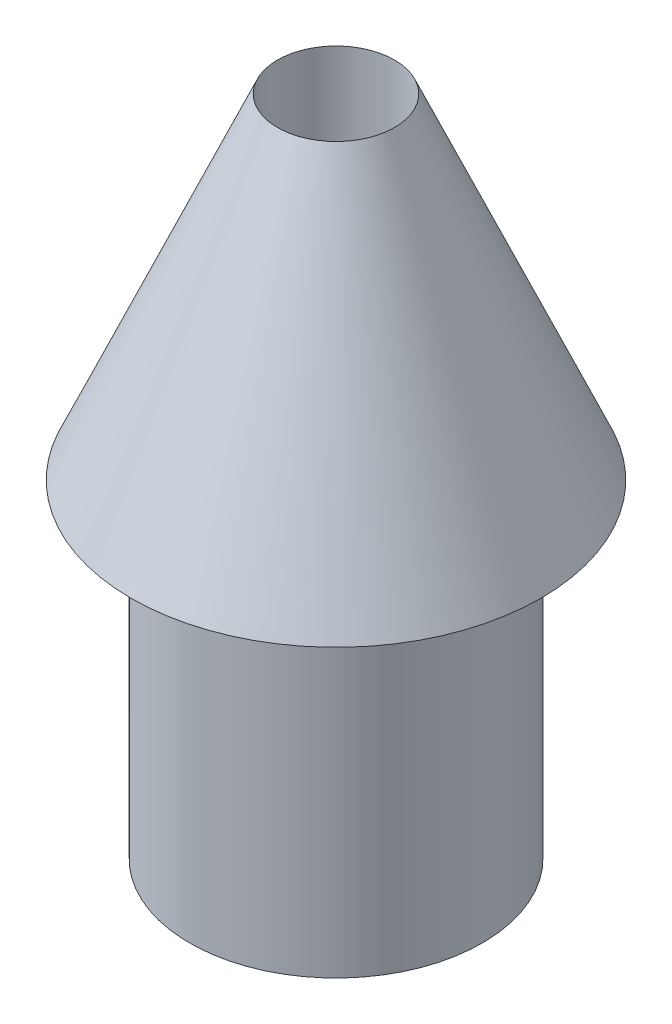
ISO-10303-21;
HEADER;
FILE_DESCRIPTION(('STEP AP214'),'2;1');
FILE_NAME('part.step','',(''),(''),'','','');
FILE_SCHEMA(('AUTOMOTIVE_DESIGN { 1 0 10303 214 1 1 1 1 }'));
ENDSEC;
DATA;
#1=APPLICATION_CONTEXT('core data for automotive mechanical design processes');
#2=APPLICATION_PROTOCOL_DEFINITION('international standard','automotive_design',2000,#1);
#3=PRODUCT_CONTEXT('',#1,'mechanical');
#4=PRODUCT('Part','Part','',(#3));
#5=PRODUCT_RELATED_PRODUCT_CATEGORY('part','',(#4));
#6=PRODUCT_DEFINITION_FORMATION('','',#4);
#7=PRODUCT_DEFINITION_CONTEXT('part definition',#1,'design');
#8=PRODUCT_DEFINITION('design','',#6,#7);
#9=PRODUCT_DEFINITION_SHAPE('','',#8);
#10=(LENGTH_UNIT() NAMED_UNIT(*) SI_UNIT(.MILLI.,.METRE.));
#11=(NAMED_UNIT(*) PLANE_ANGLE_UNIT() SI_UNIT($,.RADIAN.));
#12=(NAMED_UNIT(*) SI_UNIT($,.STERADIAN.) SOLID_ANGLE_UNIT());
#13=UNCERTAINTY_MEASURE_WITH_UNIT(LENGTH_MEASURE(1.E-05),#10,'distance_accuracy_value','');
#14=(GEOMETRIC_REPRESENTATION_CONTEXT(3) GLOBAL_UNCERTAINTY_ASSIGNED_CONTEXT((#13)) GLOBAL_UNIT_ASSIGNED_CONTEXT((#10,
#11,#12)) REPRESENTATION_CONTEXT('',''));
#15=CARTESIAN_POINT('',(0.,0.,0.));
#16=DIRECTION('',(0.,0.,1.));
#17=DIRECTION('',(1.,0.,0.));
#18=AXIS2_PLACEMENT_3D('',#15,#16,#17);
#19=CARTESIAN_POINT('',(0.,0.,0.));
#20=DIRECTION('',(0.,-1.,0.));
#21=DIRECTION('',(0.,0.,-1.));
#22=AXIS2_PLACEMENT_3D('',#19,#20,#21);
#23=PLANE('',#22);
#24=CARTESIAN_POINT('',(0.,0.,0.));
#25=DIRECTION('',(0.,-1.,0.));
#26=DIRECTION('',(0.,0.,-1.));
#27=AXIS2_PLACEMENT_3D('',#24,#25,#26);
#28=CIRCLE('',#27,1.75);
#29=CARTESIAN_POINT('',(0.,0.,-1.75));
#30=VERTEX_POINT('',#29);
#31=EDGE_CURVE('E10',#30,#30,#28,.T.);
#32=ORIENTED_EDGE('',*,*,#31,.T.);
#33=EDGE_LOOP('',(#32));
#34=FACE_BOUND('',#33,.T.);
#35=CARTESIAN_POINT('',(0.,0.,0.));
#36=DIRECTION('',(0.,-1.,0.));
#37=DIRECTION('',(0.,0.,-1.));
#38=AXIS2_PLACEMENT_3D('',#35,#36,#37);
#39=CIRCLE('',#38,1.25);
#40=CARTESIAN_POINT('',(0.,0.,-1.25));
#41=VERTEX_POINT('',#40);
#42=EDGE_CURVE('E42',#41,#41,#39,.T.);
#43=ORIENTED_EDGE('',*,*,#42,.F.);
#44=EDGE_LOOP('',(#43));
#45=FACE_BOUND('',#44,.T.);
#46=ADVANCED_FACE('F31',(#34,#45),#23,.T.);
#47=CARTESIAN_POINT('',(0.,0.,0.));
#48=DIRECTION('',(0.,-1.,0.));
#49=DIRECTION('',(0.,0.,-1.));
#50=AXIS2_PLACEMENT_3D('',#47,#48,#49);
#51=CONICAL_SURFACE('',#50,1.75,0.412410441597387);
#52=CARTESIAN_POINT('',(0.,2.85714285714286,0.));
#53=DIRECTION('',(0.,-1.,0.));
#54=DIRECTION('',(0.,0.,-1.));
#55=AXIS2_PLACEMENT_3D('',#52,#53,#54);
#56=CIRCLE('',#55,0.5);
#57=CARTESIAN_POINT('',(0.,2.85714285714286,-0.5));
#58=VERTEX_POINT('',#57);
#59=EDGE_CURVE('E47',#58,#58,#56,.F.);
#60=ORIENTED_EDGE('',*,*,#59,.F.);
#61=EDGE_LOOP('',(#60));
#62=FACE_BOUND('',#61,.T.);
#63=ORIENTED_EDGE('',*,*,#31,.F.);
#64=EDGE_LOOP('',(#63));
#65=FACE_BOUND('',#64,.T.);
#66=ADVANCED_FACE('F33',(#62,#65),#51,.T.);
#67=CARTESIAN_POINT('',(0.,-2.8,0.));
#68=DIRECTION('',(0.,1.,0.));
#69=DIRECTION('',(0.,0.,1.));
#70=AXIS2_PLACEMENT_3D('',#67,#68,#69);
#71=CYLINDRICAL_SURFACE('',#70,1.25);
#72=CARTESIAN_POINT('',(0.,-2.8,0.));
#73=DIRECTION('',(0.,-1.,0.));
#74=DIRECTION('',(0.,0.,-1.));
#75=AXIS2_PLACEMENT_3D('',#72,#73,#74);
#76=CIRCLE('',#75,1.25);
#77=CARTESIAN_POINT('',(0.,-2.8,-1.25));
#78=VERTEX_POINT('',#77);
#79=EDGE_CURVE('E38',#78,#78,#76,.T.);
#80=ORIENTED_EDGE('',*,*,#79,.F.);
#81=EDGE_LOOP('',(#80));
#82=FACE_BOUND('',#81,.T.);
#83=ORIENTED_EDGE('',*,*,#42,.T.);
#84=EDGE_LOOP('',(#83));
#85=FACE_BOUND('',#84,.T.);
#86=ADVANCED_FACE('F59',(#82,#85),#71,.T.);
#87=CARTESIAN_POINT('',(0.,-2.8,0.));
#88=DIRECTION('',(0.,-1.,0.));
#89=DIRECTION('',(0.,0.,-1.));
#90=AXIS2_PLACEMENT_3D('',#87,#88,#89);
#91=PLANE('',#90);
#92=CARTESIAN_POINT('',(0.,-2.8,0.));
#93=DIRECTION('',(0.,-1.,0.));
#94=DIRECTION('',(0.,0.,-1.));
#95=AXIS2_PLACEMENT_3D('',#92,#93,#94);
#96=CIRCLE('',#95,0.5);
#97=CARTESIAN_POINT('',(0.,-2.8,-0.5));
#98=VERTEX_POINT('',#97);
#99=EDGE_CURVE('E51',#98,#98,#96,.T.);
#100=ORIENTED_EDGE('',*,*,#99,.F.);
#101=EDGE_LOOP('',(#100));
#102=FACE_BOUND('',#101,.T.);
#103=ORIENTED_EDGE('',*,*,#79,.T.);
#104=EDGE_LOOP('',(#103));
#105=FACE_BOUND('',#104,.T.);
#106=ADVANCED_FACE('F57',(#102,#105),#91,.T.);
#107=CARTESIAN_POINT('',(0.,10.2,0.));
#108=DIRECTION('',(0.,-1.,0.));
#109=DIRECTION('',(0.,0.,-1.));
#110=AXIS2_PLACEMENT_3D('',#107,#108,#109);
#111=CYLINDRICAL_SURFACE('',#110,0.5);
#112=ORIENTED_EDGE('',*,*,#59,.T.);
#113=EDGE_LOOP('',(#112));
#114=FACE_BOUND('',#113,.T.);
#115=ORIENTED_EDGE('',*,*,#99,.T.);
#116=EDGE_LOOP('',(#115));
#117=FACE_BOUND('',#116,.T.);
#118=ADVANCED_FACE('F55',(#114,#117),#111,.F.);
#119=CLOSED_SHELL('',(#46,#66,#86,#106,#118));
#120=MANIFOLD_SOLID_BREP('B2',#119);
#121=ADVANCED_BREP_SHAPE_REPRESENTATION('',(#18,#120),#14);
#122=SHAPE_DEFINITION_REPRESENTATION(#9,#121);
ENDSEC;
END-ISO-10303-21;
